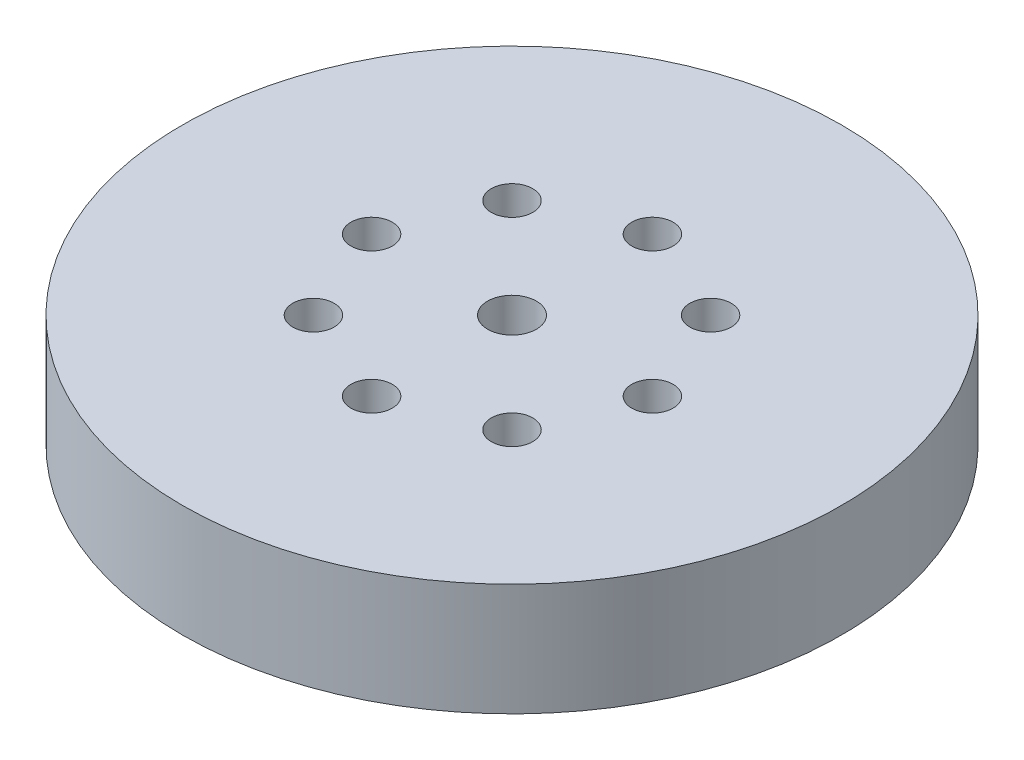
ISO-10303-21;
HEADER;
FILE_DESCRIPTION(('STEP AP214'),'2;1');
FILE_NAME('part.step','',(''),(''),'','','');
FILE_SCHEMA(('AUTOMOTIVE_DESIGN { 1 0 10303 214 1 1 1 1 }'));
ENDSEC;
DATA;
#1=APPLICATION_CONTEXT('core data for automotive mechanical design processes');
#2=APPLICATION_PROTOCOL_DEFINITION('international standard','automotive_design',2000,#1);
#3=PRODUCT_CONTEXT('',#1,'mechanical');
#4=PRODUCT('Part','Part','',(#3));
#5=PRODUCT_RELATED_PRODUCT_CATEGORY('part','',(#4));
#6=PRODUCT_DEFINITION_FORMATION('','',#4);
#7=PRODUCT_DEFINITION_CONTEXT('part definition',#1,'design');
#8=PRODUCT_DEFINITION('design','',#6,#7);
#9=PRODUCT_DEFINITION_SHAPE('','',#8);
#10=(LENGTH_UNIT() NAMED_UNIT(*) SI_UNIT(.MILLI.,.METRE.));
#11=(NAMED_UNIT(*) PLANE_ANGLE_UNIT() SI_UNIT($,.RADIAN.));
#12=(NAMED_UNIT(*) SI_UNIT($,.STERADIAN.) SOLID_ANGLE_UNIT());
#13=UNCERTAINTY_MEASURE_WITH_UNIT(LENGTH_MEASURE(1.E-05),#10,'distance_accuracy_value','');
#14=(GEOMETRIC_REPRESENTATION_CONTEXT(3) GLOBAL_UNCERTAINTY_ASSIGNED_CONTEXT((#13)) GLOBAL_UNIT_ASSIGNED_CONTEXT((#10,
#11,#12)) REPRESENTATION_CONTEXT('',''));
#15=CARTESIAN_POINT('',(0.,0.,0.));
#16=DIRECTION('',(0.,0.,1.));
#17=DIRECTION('',(1.,0.,0.));
#18=AXIS2_PLACEMENT_3D('',#15,#16,#17);
#19=CARTESIAN_POINT('',(0.,23.,0.));
#20=DIRECTION('',(0.,-1.,0.));
#21=DIRECTION('',(0.,0.,-1.));
#22=AXIS2_PLACEMENT_3D('',#19,#20,#21);
#23=CYLINDRICAL_SURFACE('',#22,67.5);
#24=CARTESIAN_POINT('',(0.,23.,0.));
#25=DIRECTION('',(0.,1.,0.));
#26=DIRECTION('',(0.,0.,1.));
#27=AXIS2_PLACEMENT_3D('',#24,#25,#26);
#28=CIRCLE('',#27,67.5);
#29=CARTESIAN_POINT('',(0.,23.,67.5));
#30=VERTEX_POINT('',#29);
#31=EDGE_CURVE('E10',#30,#30,#28,.T.);
#32=ORIENTED_EDGE('',*,*,#31,.F.);
#33=EDGE_LOOP('',(#32));
#34=FACE_BOUND('',#33,.T.);
#35=CARTESIAN_POINT('',(0.,0.,0.));
#36=DIRECTION('',(0.,1.,0.));
#37=DIRECTION('',(0.,0.,1.));
#38=AXIS2_PLACEMENT_3D('',#35,#36,#37);
#39=CIRCLE('',#38,67.5);
#40=CARTESIAN_POINT('',(0.,0.,67.5));
#41=VERTEX_POINT('',#40);
#42=EDGE_CURVE('E37',#41,#41,#39,.T.);
#43=ORIENTED_EDGE('',*,*,#42,.T.);
#44=EDGE_LOOP('',(#43));
#45=FACE_BOUND('',#44,.T.);
#46=ADVANCED_FACE('F40',(#34,#45),#23,.T.);
#47=CARTESIAN_POINT('',(0.,23.,0.));
#48=DIRECTION('',(0.,1.,0.));
#49=DIRECTION('',(0.,0.,1.));
#50=AXIS2_PLACEMENT_3D('',#47,#48,#49);
#51=PLANE('',#50);
#52=CARTESIAN_POINT('',(1.00405107147356E-13,23.,28.7571656277632));
#53=DIRECTION('',(0.,1.,0.));
#54=DIRECTION('',(1.,0.,0.));
#55=AXIS2_PLACEMENT_3D('',#52,#53,#54);
#56=CIRCLE('',#55,4.23912024442321);
#57=CARTESIAN_POINT('',(4.23912024442331,23.,28.7571656277632));
#58=VERTEX_POINT('',#57);
#59=EDGE_CURVE('E88',#58,#58,#56,.T.);
#60=ORIENTED_EDGE('',*,*,#59,.F.);
#61=EDGE_LOOP('',(#60));
#62=FACE_BOUND('',#61,.T.);
#63=CARTESIAN_POINT('',(20.3343868230962,23.,20.3343868230959));
#64=DIRECTION('',(0.,1.,0.));
#65=DIRECTION('',(0.707106781186544,0.,-0.707106781186551));
#66=AXIS2_PLACEMENT_3D('',#63,#64,#65);
#67=CIRCLE('',#66,4.23912024442321);
#68=CARTESIAN_POINT('',(23.331897494193,23.,17.3368761519991));
#69=VERTEX_POINT('',#68);
#70=EDGE_CURVE('E79',#69,#69,#67,.T.);
#71=ORIENTED_EDGE('',*,*,#70,.F.);
#72=EDGE_LOOP('',(#71));
#73=FACE_BOUND('',#72,.T.);
#74=CARTESIAN_POINT('',(28.7571656277632,23.,0.));
#75=DIRECTION('',(0.,1.,0.));
#76=DIRECTION('',(0.,0.,-1.));
#77=AXIS2_PLACEMENT_3D('',#74,#75,#76);
#78=CIRCLE('',#77,4.23912024442321);
#79=CARTESIAN_POINT('',(28.7571656277632,23.,-4.23912024442321));
#80=VERTEX_POINT('',#79);
#81=EDGE_CURVE('E74',#80,#80,#78,.T.);
#82=ORIENTED_EDGE('',*,*,#81,.F.);
#83=EDGE_LOOP('',(#82));
#84=FACE_BOUND('',#83,.T.);
#85=CARTESIAN_POINT('',(20.3343868230959,23.,-20.3343868230962));
#86=DIRECTION('',(0.,1.,0.));
#87=DIRECTION('',(-0.707106781186554,0.,-0.707106781186541));
#88=AXIS2_PLACEMENT_3D('',#85,#86,#87);
#89=CIRCLE('',#88,4.23912024442321);
#90=CARTESIAN_POINT('',(17.336876151999,23.,-23.331897494193));
#91=VERTEX_POINT('',#90);
#92=EDGE_CURVE('E70',#91,#91,#89,.T.);
#93=ORIENTED_EDGE('',*,*,#92,.F.);
#94=EDGE_LOOP('',(#93));
#95=FACE_BOUND('',#94,.T.);
#96=CARTESIAN_POINT('',(-3.01215321442069E-13,23.,-28.7571656277632));
#97=DIRECTION('',(0.,1.,0.));
#98=DIRECTION('',(-1.,0.,0.));
#99=AXIS2_PLACEMENT_3D('',#96,#97,#98);
#100=CIRCLE('',#99,4.23912024442321);
#101=CARTESIAN_POINT('',(-4.23912024442351,23.,-28.7571656277631));
#102=VERTEX_POINT('',#101);
#103=EDGE_CURVE('E100',#102,#102,#100,.T.);
#104=ORIENTED_EDGE('',*,*,#103,.F.);
#105=EDGE_LOOP('',(#104));
#106=FACE_BOUND('',#105,.T.);
#107=CARTESIAN_POINT('',(-20.3343868230963,23.,-20.3343868230958));
#108=DIRECTION('',(0.,1.,0.));
#109=DIRECTION('',(-0.707106781186539,0.,0.707106781186556));
#110=AXIS2_PLACEMENT_3D('',#107,#108,#109);
#111=CIRCLE('',#110,4.23912024442321);
#112=CARTESIAN_POINT('',(-23.3318974941931,23.,-17.3368761519989));
#113=VERTEX_POINT('',#112);
#114=EDGE_CURVE('E93',#113,#113,#111,.T.);
#115=ORIENTED_EDGE('',*,*,#114,.F.);
#116=EDGE_LOOP('',(#115));
#117=FACE_BOUND('',#116,.T.);
#118=CARTESIAN_POINT('',(-20.334386823096,23.,20.3343868230961));
#119=DIRECTION('',(0.,1.,0.));
#120=DIRECTION('',(0.707106781186549,0.,0.707106781186546));
#121=AXIS2_PLACEMENT_3D('',#118,#119,#120);
#122=CIRCLE('',#121,4.23912024442321);
#123=CARTESIAN_POINT('',(-17.3368761519992,23.,23.3318974941929));
#124=VERTEX_POINT('',#123);
#125=EDGE_CURVE('E61',#124,#124,#122,.T.);
#126=ORIENTED_EDGE('',*,*,#125,.F.);
#127=EDGE_LOOP('',(#126));
#128=FACE_BOUND('',#127,.T.);
#129=CARTESIAN_POINT('',(-28.7571656277632,23.,0.));
#130=DIRECTION('',(0.,1.,0.));
#131=DIRECTION('',(0.,0.,1.));
#132=AXIS2_PLACEMENT_3D('',#129,#130,#131);
#133=CIRCLE('',#132,4.23912024442321);
#134=CARTESIAN_POINT('',(-28.7571656277632,23.,4.23912024442321));
#135=VERTEX_POINT('',#134);
#136=EDGE_CURVE('E54',#135,#135,#133,.T.);
#137=ORIENTED_EDGE('',*,*,#136,.F.);
#138=EDGE_LOOP('',(#137));
#139=FACE_BOUND('',#138,.T.);
#140=CARTESIAN_POINT('',(0.,23.,0.));
#141=DIRECTION('',(0.,1.,0.));
#142=DIRECTION('',(0.,0.,1.));
#143=AXIS2_PLACEMENT_3D('',#140,#141,#142);
#144=CIRCLE('',#143,5.);
#145=CARTESIAN_POINT('',(0.,23.,5.));
#146=VERTEX_POINT('',#145);
#147=EDGE_CURVE('E50',#146,#146,#144,.T.);
#148=ORIENTED_EDGE('',*,*,#147,.F.);
#149=EDGE_LOOP('',(#148));
#150=FACE_BOUND('',#149,.T.);
#151=ORIENTED_EDGE('',*,*,#31,.T.);
#152=EDGE_LOOP('',(#151));
#153=FACE_BOUND('',#152,.T.);
#154=ADVANCED_FACE('F115',(#62,#73,#84,#95,#106,#117,#128,#139,#150,#153),#51,.T.);
#155=CARTESIAN_POINT('',(0.,0.,0.));
#156=DIRECTION('',(0.,1.,0.));
#157=DIRECTION('',(0.,0.,1.));
#158=AXIS2_PLACEMENT_3D('',#155,#156,#157);
#159=PLANE('',#158);
#160=CARTESIAN_POINT('',(0.,0.,0.));
#161=DIRECTION('',(0.,1.,0.));
#162=DIRECTION('',(0.,0.,1.));
#163=AXIS2_PLACEMENT_3D('',#160,#161,#162);
#164=CIRCLE('',#163,5.);
#165=CARTESIAN_POINT('',(0.,0.,5.));
#166=VERTEX_POINT('',#165);
#167=EDGE_CURVE('E47',#166,#166,#164,.T.);
#168=ORIENTED_EDGE('',*,*,#167,.T.);
#169=EDGE_LOOP('',(#168));
#170=FACE_BOUND('',#169,.T.);
#171=ORIENTED_EDGE('',*,*,#42,.F.);
#172=EDGE_LOOP('',(#171));
#173=FACE_BOUND('',#172,.T.);
#174=ADVANCED_FACE('F113',(#170,#173),#159,.F.);
#175=CARTESIAN_POINT('',(0.,23.,0.));
#176=DIRECTION('',(0.,-1.,0.));
#177=DIRECTION('',(0.,0.,-1.));
#178=AXIS2_PLACEMENT_3D('',#175,#176,#177);
#179=CYLINDRICAL_SURFACE('',#178,5.);
#180=ORIENTED_EDGE('',*,*,#147,.T.);
#181=EDGE_LOOP('',(#180));
#182=FACE_BOUND('',#181,.T.);
#183=ORIENTED_EDGE('',*,*,#167,.F.);
#184=EDGE_LOOP('',(#183));
#185=FACE_BOUND('',#184,.T.);
#186=ADVANCED_FACE('F127',(#182,#185),#179,.F.);
#187=CARTESIAN_POINT('',(-28.7571656277632,1.26350561303543,0.));
#188=DIRECTION('',(0.,1.,0.));
#189=DIRECTION('',(0.,0.,1.));
#190=AXIS2_PLACEMENT_3D('',#187,#188,#189);
#191=CYLINDRICAL_SURFACE('',#190,4.23912024442321);
#192=CARTESIAN_POINT('',(-28.7571656277632,1.26350561303543,0.));
#193=DIRECTION('',(0.,1.,0.));
#194=DIRECTION('',(0.,0.,1.));
#195=AXIS2_PLACEMENT_3D('',#192,#193,#194);
#196=CIRCLE('',#195,4.23912024442321);
#197=CARTESIAN_POINT('',(-28.7571656277632,1.26350561303543,4.23912024442321));
#198=VERTEX_POINT('',#197);
#199=EDGE_CURVE('E55',#198,#198,#196,.T.);
#200=ORIENTED_EDGE('',*,*,#199,.F.);
#201=EDGE_LOOP('',(#200));
#202=FACE_BOUND('',#201,.T.);
#203=ORIENTED_EDGE('',*,*,#136,.T.);
#204=EDGE_LOOP('',(#203));
#205=FACE_BOUND('',#204,.T.);
#206=ADVANCED_FACE('F129',(#202,#205),#191,.F.);
#207=CARTESIAN_POINT('',(-28.7571656277632,1.26350561303543,0.));
#208=DIRECTION('',(0.,1.,0.));
#209=DIRECTION('',(0.,0.,1.));
#210=AXIS2_PLACEMENT_3D('',#207,#208,#209);
#211=PLANE('',#210);
#212=ORIENTED_EDGE('',*,*,#199,.T.);
#213=EDGE_LOOP('',(#212));
#214=FACE_BOUND('',#213,.T.);
#215=ADVANCED_FACE('F157',(#214),#211,.T.);
#216=CARTESIAN_POINT('',(-20.334386823096,1.26350561303543,20.3343868230961));
#217=DIRECTION('',(0.,1.,0.));
#218=DIRECTION('',(0.,0.,1.));
#219=AXIS2_PLACEMENT_3D('',#216,#217,#218);
#220=CYLINDRICAL_SURFACE('',#219,4.23912024442321);
#221=CARTESIAN_POINT('',(-20.334386823096,1.26350561303543,20.3343868230961));
#222=DIRECTION('',(0.,1.,0.));
#223=DIRECTION('',(0.707106781186549,0.,0.707106781186546));
#224=AXIS2_PLACEMENT_3D('',#221,#222,#223);
#225=CIRCLE('',#224,4.23912024442321);
#226=CARTESIAN_POINT('',(-17.3368761519992,1.26350561303543,23.3318974941929));
#227=VERTEX_POINT('',#226);
#228=EDGE_CURVE('E59',#227,#227,#225,.T.);
#229=ORIENTED_EDGE('',*,*,#228,.F.);
#230=EDGE_LOOP('',(#229));
#231=FACE_BOUND('',#230,.T.);
#232=ORIENTED_EDGE('',*,*,#125,.T.);
#233=EDGE_LOOP('',(#232));
#234=FACE_BOUND('',#233,.T.);
#235=ADVANCED_FACE('F170',(#231,#234),#220,.F.);
#236=CARTESIAN_POINT('',(-20.334386823096,1.26350561303543,20.3343868230961));
#237=DIRECTION('',(0.,1.,0.));
#238=DIRECTION('',(0.707106781186549,0.,0.707106781186546));
#239=AXIS2_PLACEMENT_3D('',#236,#237,#238);
#240=PLANE('',#239);
#241=ORIENTED_EDGE('',*,*,#228,.T.);
#242=EDGE_LOOP('',(#241));
#243=FACE_BOUND('',#242,.T.);
#244=ADVANCED_FACE('F182',(#243),#240,.T.);
#245=CARTESIAN_POINT('',(-20.3343868230963,1.26350561303543,-20.3343868230958));
#246=DIRECTION('',(0.,1.,0.));
#247=DIRECTION('',(0.,0.,1.));
#248=AXIS2_PLACEMENT_3D('',#245,#246,#247);
#249=CYLINDRICAL_SURFACE('',#248,4.23912024442321);
#250=CARTESIAN_POINT('',(-20.3343868230963,1.26350561303543,-20.3343868230958));
#251=DIRECTION('',(0.,1.,0.));
#252=DIRECTION('',(-0.707106781186539,0.,0.707106781186556));
#253=AXIS2_PLACEMENT_3D('',#250,#251,#252);
#254=CIRCLE('',#253,4.23912024442321);
#255=CARTESIAN_POINT('',(-23.3318974941931,1.26350561303543,-17.3368761519989));
#256=VERTEX_POINT('',#255);
#257=EDGE_CURVE('E94',#256,#256,#254,.T.);
#258=ORIENTED_EDGE('',*,*,#257,.F.);
#259=EDGE_LOOP('',(#258));
#260=FACE_BOUND('',#259,.T.);
#261=ORIENTED_EDGE('',*,*,#114,.T.);
#262=EDGE_LOOP('',(#261));
#263=FACE_BOUND('',#262,.T.);
#264=ADVANCED_FACE('F189',(#260,#263),#249,.F.);
#265=CARTESIAN_POINT('',(-20.3343868230963,1.26350561303543,-20.3343868230958));
#266=DIRECTION('',(0.,1.,0.));
#267=DIRECTION('',(-0.707106781186539,0.,0.707106781186556));
#268=AXIS2_PLACEMENT_3D('',#265,#266,#267);
#269=PLANE('',#268);
#270=ORIENTED_EDGE('',*,*,#257,.T.);
#271=EDGE_LOOP('',(#270));
#272=FACE_BOUND('',#271,.T.);
#273=ADVANCED_FACE('F107',(#272),#269,.T.);
#274=CARTESIAN_POINT('',(-3.01215321442069E-13,1.26350561303543,-28.7571656277632));
#275=DIRECTION('',(0.,1.,0.));
#276=DIRECTION('',(0.,0.,1.));
#277=AXIS2_PLACEMENT_3D('',#274,#275,#276);
#278=CYLINDRICAL_SURFACE('',#277,4.23912024442321);
#279=CARTESIAN_POINT('',(-3.01215321442069E-13,1.26350561303543,-28.7571656277632));
#280=DIRECTION('',(0.,1.,0.));
#281=DIRECTION('',(-1.,0.,0.));
#282=AXIS2_PLACEMENT_3D('',#279,#280,#281);
#283=CIRCLE('',#282,4.23912024442321);
#284=CARTESIAN_POINT('',(-4.23912024442351,1.26350561303543,-28.7571656277631));
#285=VERTEX_POINT('',#284);
#286=EDGE_CURVE('E72',#285,#285,#283,.T.);
#287=ORIENTED_EDGE('',*,*,#286,.F.);
#288=EDGE_LOOP('',(#287));
#289=FACE_BOUND('',#288,.T.);
#290=ORIENTED_EDGE('',*,*,#103,.T.);
#291=EDGE_LOOP('',(#290));
#292=FACE_BOUND('',#291,.T.);
#293=ADVANCED_FACE('F104',(#289,#292),#278,.F.);
#294=CARTESIAN_POINT('',(-3.01215321442069E-13,1.26350561303543,-28.7571656277632));
#295=DIRECTION('',(0.,1.,0.));
#296=DIRECTION('',(-1.,0.,0.));
#297=AXIS2_PLACEMENT_3D('',#294,#295,#296);
#298=PLANE('',#297);
#299=ORIENTED_EDGE('',*,*,#286,.T.);
#300=EDGE_LOOP('',(#299));
#301=FACE_BOUND('',#300,.T.);
#302=ADVANCED_FACE('F103',(#301),#298,.T.);
#303=CARTESIAN_POINT('',(20.3343868230959,1.26350561303543,-20.3343868230962));
#304=DIRECTION('',(0.,1.,0.));
#305=DIRECTION('',(0.,0.,1.));
#306=AXIS2_PLACEMENT_3D('',#303,#304,#305);
#307=CYLINDRICAL_SURFACE('',#306,4.23912024442321);
#308=CARTESIAN_POINT('',(20.3343868230959,1.26350561303543,-20.3343868230962));
#309=DIRECTION('',(0.,1.,0.));
#310=DIRECTION('',(-0.707106781186554,0.,-0.707106781186541));
#311=AXIS2_PLACEMENT_3D('',#308,#309,#310);
#312=CIRCLE('',#311,4.23912024442321);
#313=CARTESIAN_POINT('',(17.336876151999,1.26350561303543,-23.331897494193));
#314=VERTEX_POINT('',#313);
#315=EDGE_CURVE('E69',#314,#314,#312,.T.);
#316=ORIENTED_EDGE('',*,*,#315,.F.);
#317=EDGE_LOOP('',(#316));
#318=FACE_BOUND('',#317,.T.);
#319=ORIENTED_EDGE('',*,*,#92,.T.);
#320=EDGE_LOOP('',(#319));
#321=FACE_BOUND('',#320,.T.);
#322=ADVANCED_FACE('F219',(#318,#321),#307,.F.);
#323=CARTESIAN_POINT('',(20.3343868230959,1.26350561303543,-20.3343868230962));
#324=DIRECTION('',(0.,1.,0.));
#325=DIRECTION('',(-0.707106781186554,0.,-0.707106781186541));
#326=AXIS2_PLACEMENT_3D('',#323,#324,#325);
#327=PLANE('',#326);
#328=ORIENTED_EDGE('',*,*,#315,.T.);
#329=EDGE_LOOP('',(#328));
#330=FACE_BOUND('',#329,.T.);
#331=ADVANCED_FACE('F227',(#330),#327,.T.);
#332=CARTESIAN_POINT('',(28.7571656277632,1.26350561303543,0.));
#333=DIRECTION('',(0.,1.,0.));
#334=DIRECTION('',(0.,0.,1.));
#335=AXIS2_PLACEMENT_3D('',#332,#333,#334);
#336=CYLINDRICAL_SURFACE('',#335,4.23912024442321);
#337=CARTESIAN_POINT('',(28.7571656277632,1.26350561303543,0.));
#338=DIRECTION('',(0.,1.,0.));
#339=DIRECTION('',(0.,0.,-1.));
#340=AXIS2_PLACEMENT_3D('',#337,#338,#339);
#341=CIRCLE('',#340,4.23912024442321);
#342=CARTESIAN_POINT('',(28.7571656277632,1.26350561303543,-4.23912024442321));
#343=VERTEX_POINT('',#342);
#344=EDGE_CURVE('E80',#343,#343,#341,.T.);
#345=ORIENTED_EDGE('',*,*,#344,.F.);
#346=EDGE_LOOP('',(#345));
#347=FACE_BOUND('',#346,.T.);
#348=ORIENTED_EDGE('',*,*,#81,.T.);
#349=EDGE_LOOP('',(#348));
#350=FACE_BOUND('',#349,.T.);
#351=ADVANCED_FACE('F240',(#347,#350),#336,.F.);
#352=CARTESIAN_POINT('',(28.7571656277632,1.26350561303543,0.));
#353=DIRECTION('',(0.,1.,0.));
#354=DIRECTION('',(0.,0.,-1.));
#355=AXIS2_PLACEMENT_3D('',#352,#353,#354);
#356=PLANE('',#355);
#357=ORIENTED_EDGE('',*,*,#344,.T.);
#358=EDGE_LOOP('',(#357));
#359=FACE_BOUND('',#358,.T.);
#360=ADVANCED_FACE('F246',(#359),#356,.T.);
#361=CARTESIAN_POINT('',(20.3343868230962,1.26350561303543,20.3343868230959));
#362=DIRECTION('',(0.,1.,0.));
#363=DIRECTION('',(0.,0.,1.));
#364=AXIS2_PLACEMENT_3D('',#361,#362,#363);
#365=CYLINDRICAL_SURFACE('',#364,4.23912024442321);
#366=CARTESIAN_POINT('',(20.3343868230962,1.26350561303543,20.3343868230959));
#367=DIRECTION('',(0.,1.,0.));
#368=DIRECTION('',(0.707106781186544,0.,-0.707106781186551));
#369=AXIS2_PLACEMENT_3D('',#366,#367,#368);
#370=CIRCLE('',#369,4.23912024442321);
#371=CARTESIAN_POINT('',(23.331897494193,1.26350561303543,17.3368761519991));
#372=VERTEX_POINT('',#371);
#373=EDGE_CURVE('E82',#372,#372,#370,.T.);
#374=ORIENTED_EDGE('',*,*,#373,.F.);
#375=EDGE_LOOP('',(#374));
#376=FACE_BOUND('',#375,.T.);
#377=ORIENTED_EDGE('',*,*,#70,.T.);
#378=EDGE_LOOP('',(#377));
#379=FACE_BOUND('',#378,.T.);
#380=ADVANCED_FACE('F254',(#376,#379),#365,.F.);
#381=CARTESIAN_POINT('',(20.3343868230962,1.26350561303543,20.3343868230959));
#382=DIRECTION('',(0.,1.,0.));
#383=DIRECTION('',(0.707106781186544,0.,-0.707106781186551));
#384=AXIS2_PLACEMENT_3D('',#381,#382,#383);
#385=PLANE('',#384);
#386=ORIENTED_EDGE('',*,*,#373,.T.);
#387=EDGE_LOOP('',(#386));
#388=FACE_BOUND('',#387,.T.);
#389=ADVANCED_FACE('F262',(#388),#385,.T.);
#390=CARTESIAN_POINT('',(1.00405107147356E-13,1.26350561303543,28.7571656277632));
#391=DIRECTION('',(0.,1.,0.));
#392=DIRECTION('',(0.,0.,1.));
#393=AXIS2_PLACEMENT_3D('',#390,#391,#392);
#394=CYLINDRICAL_SURFACE('',#393,4.23912024442321);
#395=CARTESIAN_POINT('',(1.00405107147356E-13,1.26350561303543,28.7571656277632));
#396=DIRECTION('',(0.,1.,0.));
#397=DIRECTION('',(1.,0.,0.));
#398=AXIS2_PLACEMENT_3D('',#395,#396,#397);
#399=CIRCLE('',#398,4.23912024442321);
#400=CARTESIAN_POINT('',(4.23912024442331,1.26350561303543,28.7571656277632));
#401=VERTEX_POINT('',#400);
#402=EDGE_CURVE('E63',#401,#401,#399,.T.);
#403=ORIENTED_EDGE('',*,*,#402,.F.);
#404=EDGE_LOOP('',(#403));
#405=FACE_BOUND('',#404,.T.);
#406=ORIENTED_EDGE('',*,*,#59,.T.);
#407=EDGE_LOOP('',(#406));
#408=FACE_BOUND('',#407,.T.);
#409=ADVANCED_FACE('F272',(#405,#408),#394,.F.);
#410=CARTESIAN_POINT('',(1.00405107147356E-13,1.26350561303543,28.7571656277632));
#411=DIRECTION('',(0.,1.,0.));
#412=DIRECTION('',(1.,0.,0.));
#413=AXIS2_PLACEMENT_3D('',#410,#411,#412);
#414=PLANE('',#413);
#415=ORIENTED_EDGE('',*,*,#402,.T.);
#416=EDGE_LOOP('',(#415));
#417=FACE_BOUND('',#416,.T.);
#418=ADVANCED_FACE('F285',(#417),#414,.T.);
#419=CLOSED_SHELL('',(#46,#154,#174,#186,#206,#215,#235,#244,#264,#273,#293,#302,#322,#331,#351,
#360,#380,#389,#409,#418));
#420=MANIFOLD_SOLID_BREP('B2',#419);
#421=ADVANCED_BREP_SHAPE_REPRESENTATION('',(#18,#420),#14);
#422=SHAPE_DEFINITION_REPRESENTATION(#9,#421);
ENDSEC;
END-ISO-10303-21;
